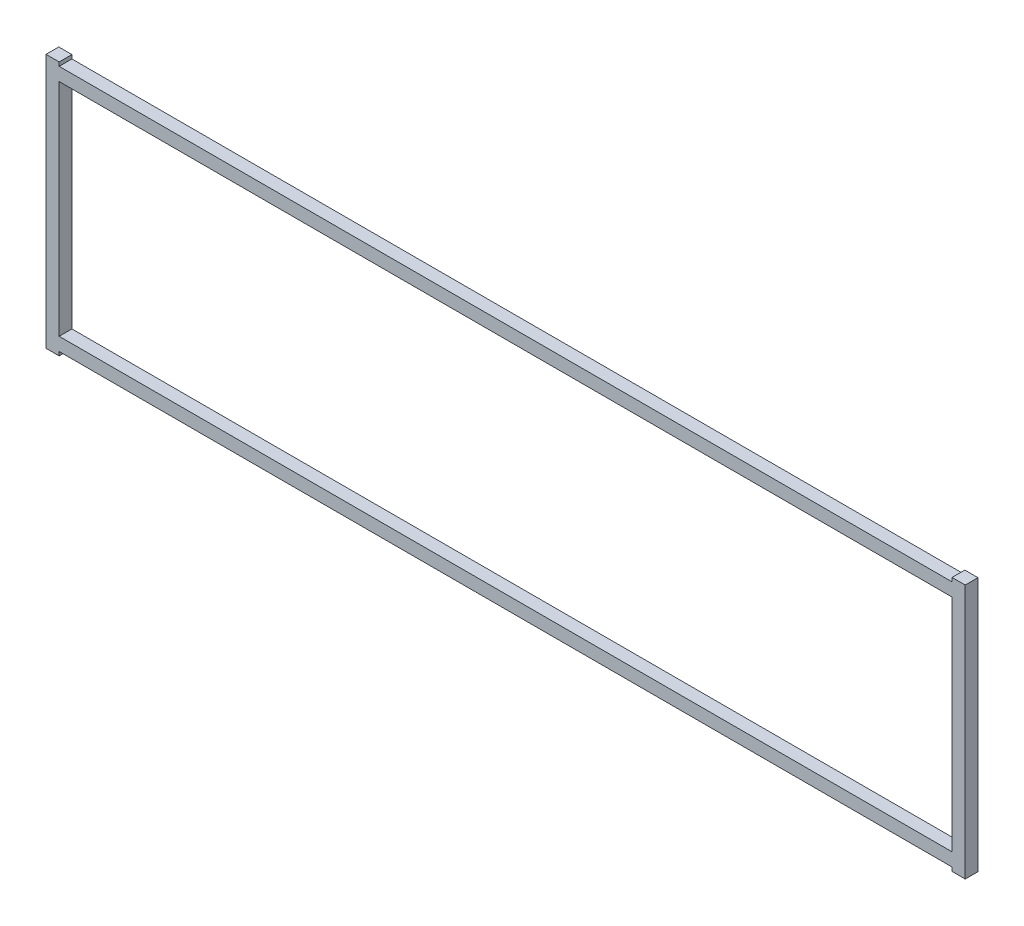
ISO-10303-21;
HEADER;
FILE_DESCRIPTION(('STEP AP214'),'2;1');
FILE_NAME('part.step','',(''),(''),'','','');
FILE_SCHEMA(('AUTOMOTIVE_DESIGN { 1 0 10303 214 1 1 1 1 }'));
ENDSEC;
DATA;
#1=APPLICATION_CONTEXT('core data for automotive mechanical design processes');
#2=APPLICATION_PROTOCOL_DEFINITION('international standard','automotive_design',2000,#1);
#3=PRODUCT_CONTEXT('',#1,'mechanical');
#4=PRODUCT('Part','Part','',(#3));
#5=PRODUCT_RELATED_PRODUCT_CATEGORY('part','',(#4));
#6=PRODUCT_DEFINITION_FORMATION('','',#4);
#7=PRODUCT_DEFINITION_CONTEXT('part definition',#1,'design');
#8=PRODUCT_DEFINITION('design','',#6,#7);
#9=PRODUCT_DEFINITION_SHAPE('','',#8);
#10=(LENGTH_UNIT() NAMED_UNIT(*) SI_UNIT(.MILLI.,.METRE.));
#11=(NAMED_UNIT(*) PLANE_ANGLE_UNIT() SI_UNIT($,.RADIAN.));
#12=(NAMED_UNIT(*) SI_UNIT($,.STERADIAN.) SOLID_ANGLE_UNIT());
#13=UNCERTAINTY_MEASURE_WITH_UNIT(LENGTH_MEASURE(1.E-05),#10,'distance_accuracy_value','');
#14=(GEOMETRIC_REPRESENTATION_CONTEXT(3) GLOBAL_UNCERTAINTY_ASSIGNED_CONTEXT((#13)) GLOBAL_UNIT_ASSIGNED_CONTEXT((#10,
#11,#12)) REPRESENTATION_CONTEXT('',''));
#15=CARTESIAN_POINT('',(0.,0.,0.));
#16=DIRECTION('',(0.,0.,1.));
#17=DIRECTION('',(1.,0.,0.));
#18=AXIS2_PLACEMENT_3D('',#15,#16,#17);
#19=CARTESIAN_POINT('',(0.,0.,6.35));
#20=DIRECTION('',(0.,0.,1.));
#21=DIRECTION('',(1.,0.,0.));
#22=AXIS2_PLACEMENT_3D('',#19,#20,#21);
#23=PLANE('',#22);
#24=DIRECTION('',(0.,-1.,0.));
#25=VECTOR('',#24,1.);
#26=CARTESIAN_POINT('',(222.1484,-61.445775,6.35));
#27=LINE('',#26,#25);
#28=CARTESIAN_POINT('',(222.1484,-61.445775,6.35));
#29=VERTEX_POINT('',#28);
#30=CARTESIAN_POINT('',(222.1484,-63.35395,6.35));
#31=VERTEX_POINT('',#30);
#32=EDGE_CURVE('E201',#29,#31,#27,.T.);
#33=ORIENTED_EDGE('',*,*,#32,.T.);
#34=DIRECTION('',(1.,0.,0.));
#35=VECTOR('',#34,1.);
#36=CARTESIAN_POINT('',(222.1484,-63.35395,6.35));
#37=LINE('',#36,#35);
#38=CARTESIAN_POINT('',(228.7016,-63.35395,6.35));
#39=VERTEX_POINT('',#38);
#40=EDGE_CURVE('E205',#31,#39,#37,.T.);
#41=ORIENTED_EDGE('',*,*,#40,.T.);
#42=DIRECTION('',(0.,1.,0.));
#43=VECTOR('',#42,1.);
#44=CARTESIAN_POINT('',(228.7016,-63.35395,6.35));
#45=LINE('',#44,#43);
#46=CARTESIAN_POINT('',(228.7016,63.35395,6.35));
#47=VERTEX_POINT('',#46);
#48=EDGE_CURVE('E209',#39,#47,#45,.T.);
#49=ORIENTED_EDGE('',*,*,#48,.T.);
#50=DIRECTION('',(-1.,0.,0.));
#51=VECTOR('',#50,1.);
#52=CARTESIAN_POINT('',(228.7016,63.35395,6.35));
#53=LINE('',#52,#51);
#54=CARTESIAN_POINT('',(222.1484,63.35395,6.35));
#55=VERTEX_POINT('',#54);
#56=EDGE_CURVE('E212',#47,#55,#53,.T.);
#57=ORIENTED_EDGE('',*,*,#56,.T.);
#58=DIRECTION('',(0.,-1.,0.));
#59=VECTOR('',#58,1.);
#60=CARTESIAN_POINT('',(222.1484,63.35395,6.35));
#61=LINE('',#60,#59);
#62=CARTESIAN_POINT('',(222.1484,61.445775,6.35));
#63=VERTEX_POINT('',#62);
#64=EDGE_CURVE('E215',#55,#63,#61,.T.);
#65=ORIENTED_EDGE('',*,*,#64,.T.);
#66=DIRECTION('',(-1.,0.,0.));
#67=VECTOR('',#66,1.);
#68=CARTESIAN_POINT('',(222.1484,61.445775,6.35));
#69=LINE('',#68,#67);
#70=CARTESIAN_POINT('',(-222.1484,61.445775,6.35));
#71=VERTEX_POINT('',#70);
#72=EDGE_CURVE('E218',#63,#71,#69,.T.);
#73=ORIENTED_EDGE('',*,*,#72,.T.);
#74=DIRECTION('',(0.,1.,0.));
#75=VECTOR('',#74,1.);
#76=CARTESIAN_POINT('',(-222.1484,61.445775,6.35));
#77=LINE('',#76,#75);
#78=CARTESIAN_POINT('',(-222.1484,63.35395,6.35));
#79=VERTEX_POINT('',#78);
#80=EDGE_CURVE('E221',#71,#79,#77,.T.);
#81=ORIENTED_EDGE('',*,*,#80,.T.);
#82=DIRECTION('',(-1.,0.,0.));
#83=VECTOR('',#82,1.);
#84=CARTESIAN_POINT('',(-222.1484,63.35395,6.35));
#85=LINE('',#84,#83);
#86=CARTESIAN_POINT('',(-228.7016,63.35395,6.35));
#87=VERTEX_POINT('',#86);
#88=EDGE_CURVE('E224',#79,#87,#85,.T.);
#89=ORIENTED_EDGE('',*,*,#88,.T.);
#90=DIRECTION('',(0.,-1.,0.));
#91=VECTOR('',#90,1.);
#92=CARTESIAN_POINT('',(-228.7016,63.35395,6.35));
#93=LINE('',#92,#91);
#94=CARTESIAN_POINT('',(-228.7016,-63.35395,6.35));
#95=VERTEX_POINT('',#94);
#96=EDGE_CURVE('E227',#87,#95,#93,.T.);
#97=ORIENTED_EDGE('',*,*,#96,.T.);
#98=DIRECTION('',(1.,0.,0.));
#99=VECTOR('',#98,1.);
#100=CARTESIAN_POINT('',(-228.7016,-63.35395,6.35));
#101=LINE('',#100,#99);
#102=CARTESIAN_POINT('',(-222.1484,-63.35395,6.35));
#103=VERTEX_POINT('',#102);
#104=EDGE_CURVE('E230',#95,#103,#101,.T.);
#105=ORIENTED_EDGE('',*,*,#104,.T.);
#106=DIRECTION('',(0.,1.,0.));
#107=VECTOR('',#106,1.);
#108=CARTESIAN_POINT('',(-222.1484,-63.35395,6.35));
#109=LINE('',#108,#107);
#110=CARTESIAN_POINT('',(-222.1484,-61.445775,6.35));
#111=VERTEX_POINT('',#110);
#112=EDGE_CURVE('E233',#103,#111,#109,.T.);
#113=ORIENTED_EDGE('',*,*,#112,.T.);
#114=DIRECTION('',(1.,0.,0.));
#115=VECTOR('',#114,1.);
#116=CARTESIAN_POINT('',(-222.1484,-61.445775,6.35));
#117=LINE('',#116,#115);
#118=EDGE_CURVE('E236',#111,#29,#117,.T.);
#119=ORIENTED_EDGE('',*,*,#118,.T.);
#120=EDGE_LOOP('',(#33,#41,#49,#57,#65,#73,#81,#89,#97,#105,#113,#119));
#121=FACE_BOUND('',#120,.T.);
#122=DIRECTION('',(1.,0.,0.));
#123=VECTOR('',#122,1.);
#124=CARTESIAN_POINT('',(-222.1484,-54.892575,6.35));
#125=LINE('',#124,#123);
#126=CARTESIAN_POINT('',(-222.1484,-54.892575,6.35));
#127=VERTEX_POINT('',#126);
#128=CARTESIAN_POINT('',(222.1484,-54.892575,6.35));
#129=VERTEX_POINT('',#128);
#130=EDGE_CURVE('E162',#127,#129,#125,.T.);
#131=ORIENTED_EDGE('',*,*,#130,.F.);
#132=DIRECTION('',(0.,-1.,0.));
#133=VECTOR('',#132,1.);
#134=CARTESIAN_POINT('',(-222.1484,54.892575,6.35));
#135=LINE('',#134,#133);
#136=CARTESIAN_POINT('',(-222.1484,54.892575,6.35));
#137=VERTEX_POINT('',#136);
#138=EDGE_CURVE('E153',#137,#127,#135,.T.);
#139=ORIENTED_EDGE('',*,*,#138,.F.);
#140=DIRECTION('',(-1.,0.,0.));
#141=VECTOR('',#140,1.);
#142=CARTESIAN_POINT('',(222.1484,54.892575,6.35));
#143=LINE('',#142,#141);
#144=CARTESIAN_POINT('',(222.1484,54.892575,6.35));
#145=VERTEX_POINT('',#144);
#146=EDGE_CURVE('E179',#145,#137,#143,.T.);
#147=ORIENTED_EDGE('',*,*,#146,.F.);
#148=DIRECTION('',(0.,1.,0.));
#149=VECTOR('',#148,1.);
#150=CARTESIAN_POINT('',(222.1484,-54.892575,6.35));
#151=LINE('',#150,#149);
#152=EDGE_CURVE('E175',#129,#145,#151,.T.);
#153=ORIENTED_EDGE('',*,*,#152,.F.);
#154=EDGE_LOOP('',(#131,#139,#147,#153));
#155=FACE_BOUND('',#154,.T.);
#156=ADVANCED_FACE('F39',(#121,#155),#23,.T.);
#157=CARTESIAN_POINT('',(0.,0.,0.));
#158=DIRECTION('',(0.,0.,1.));
#159=DIRECTION('',(1.,0.,0.));
#160=AXIS2_PLACEMENT_3D('',#157,#158,#159);
#161=PLANE('',#160);
#162=DIRECTION('',(0.,-1.,0.));
#163=VECTOR('',#162,1.);
#164=CARTESIAN_POINT('',(222.1484,-61.445775,0.));
#165=LINE('',#164,#163);
#166=CARTESIAN_POINT('',(222.1484,-61.445775,0.));
#167=VERTEX_POINT('',#166);
#168=CARTESIAN_POINT('',(222.1484,-63.35395,0.));
#169=VERTEX_POINT('',#168);
#170=EDGE_CURVE('E171',#167,#169,#165,.T.);
#171=ORIENTED_EDGE('',*,*,#170,.F.);
#172=DIRECTION('',(1.,0.,0.));
#173=VECTOR('',#172,1.);
#174=CARTESIAN_POINT('',(-222.1484,-61.445775,0.));
#175=LINE('',#174,#173);
#176=CARTESIAN_POINT('',(-222.1484,-61.445775,0.));
#177=VERTEX_POINT('',#176);
#178=EDGE_CURVE('E206',#177,#167,#175,.T.);
#179=ORIENTED_EDGE('',*,*,#178,.F.);
#180=DIRECTION('',(0.,1.,0.));
#181=VECTOR('',#180,1.);
#182=CARTESIAN_POINT('',(-222.1484,-63.35395,0.));
#183=LINE('',#182,#181);
#184=CARTESIAN_POINT('',(-222.1484,-63.35395,0.));
#185=VERTEX_POINT('',#184);
#186=EDGE_CURVE('E270',#185,#177,#183,.T.);
#187=ORIENTED_EDGE('',*,*,#186,.F.);
#188=DIRECTION('',(1.,0.,0.));
#189=VECTOR('',#188,1.);
#190=CARTESIAN_POINT('',(-228.7016,-63.35395,0.));
#191=LINE('',#190,#189);
#192=CARTESIAN_POINT('',(-228.7016,-63.35395,0.));
#193=VERTEX_POINT('',#192);
#194=EDGE_CURVE('E267',#193,#185,#191,.T.);
#195=ORIENTED_EDGE('',*,*,#194,.F.);
#196=DIRECTION('',(0.,-1.,0.));
#197=VECTOR('',#196,1.);
#198=CARTESIAN_POINT('',(-228.7016,63.35395,0.));
#199=LINE('',#198,#197);
#200=CARTESIAN_POINT('',(-228.7016,63.35395,0.));
#201=VERTEX_POINT('',#200);
#202=EDGE_CURVE('E264',#201,#193,#199,.T.);
#203=ORIENTED_EDGE('',*,*,#202,.F.);
#204=DIRECTION('',(-1.,0.,0.));
#205=VECTOR('',#204,1.);
#206=CARTESIAN_POINT('',(-222.1484,63.35395,0.));
#207=LINE('',#206,#205);
#208=CARTESIAN_POINT('',(-222.1484,63.35395,0.));
#209=VERTEX_POINT('',#208);
#210=EDGE_CURVE('E261',#209,#201,#207,.T.);
#211=ORIENTED_EDGE('',*,*,#210,.F.);
#212=DIRECTION('',(0.,1.,0.));
#213=VECTOR('',#212,1.);
#214=CARTESIAN_POINT('',(-222.1484,61.445775,0.));
#215=LINE('',#214,#213);
#216=CARTESIAN_POINT('',(-222.1484,61.445775,0.));
#217=VERTEX_POINT('',#216);
#218=EDGE_CURVE('E258',#217,#209,#215,.T.);
#219=ORIENTED_EDGE('',*,*,#218,.F.);
#220=DIRECTION('',(-1.,0.,0.));
#221=VECTOR('',#220,1.);
#222=CARTESIAN_POINT('',(222.1484,61.445775,0.));
#223=LINE('',#222,#221);
#224=CARTESIAN_POINT('',(222.1484,61.445775,0.));
#225=VERTEX_POINT('',#224);
#226=EDGE_CURVE('E255',#225,#217,#223,.T.);
#227=ORIENTED_EDGE('',*,*,#226,.F.);
#228=DIRECTION('',(0.,-1.,0.));
#229=VECTOR('',#228,1.);
#230=CARTESIAN_POINT('',(222.1484,63.35395,0.));
#231=LINE('',#230,#229);
#232=CARTESIAN_POINT('',(222.1484,63.35395,0.));
#233=VERTEX_POINT('',#232);
#234=EDGE_CURVE('E252',#233,#225,#231,.T.);
#235=ORIENTED_EDGE('',*,*,#234,.F.);
#236=DIRECTION('',(-1.,0.,0.));
#237=VECTOR('',#236,1.);
#238=CARTESIAN_POINT('',(228.7016,63.35395,0.));
#239=LINE('',#238,#237);
#240=CARTESIAN_POINT('',(228.7016,63.35395,0.));
#241=VERTEX_POINT('',#240);
#242=EDGE_CURVE('E249',#241,#233,#239,.T.);
#243=ORIENTED_EDGE('',*,*,#242,.F.);
#244=DIRECTION('',(0.,1.,0.));
#245=VECTOR('',#244,1.);
#246=CARTESIAN_POINT('',(228.7016,-63.35395,0.));
#247=LINE('',#246,#245);
#248=CARTESIAN_POINT('',(228.7016,-63.35395,0.));
#249=VERTEX_POINT('',#248);
#250=EDGE_CURVE('E246',#249,#241,#247,.T.);
#251=ORIENTED_EDGE('',*,*,#250,.F.);
#252=DIRECTION('',(1.,0.,0.));
#253=VECTOR('',#252,1.);
#254=CARTESIAN_POINT('',(222.1484,-63.35395,0.));
#255=LINE('',#254,#253);
#256=EDGE_CURVE('E243',#169,#249,#255,.T.);
#257=ORIENTED_EDGE('',*,*,#256,.F.);
#258=EDGE_LOOP('',(#171,#179,#187,#195,#203,#211,#219,#227,#235,#243,#251,#257));
#259=FACE_BOUND('',#258,.T.);
#260=DIRECTION('',(0.,-1.,0.));
#261=VECTOR('',#260,1.);
#262=CARTESIAN_POINT('',(-222.1484,54.892575,0.));
#263=LINE('',#262,#261);
#264=CARTESIAN_POINT('',(-222.1484,54.892575,0.));
#265=VERTEX_POINT('',#264);
#266=CARTESIAN_POINT('',(-222.1484,-54.892575,0.));
#267=VERTEX_POINT('',#266);
#268=EDGE_CURVE('E63',#265,#267,#263,.T.);
#269=ORIENTED_EDGE('',*,*,#268,.T.);
#270=DIRECTION('',(1.,0.,0.));
#271=VECTOR('',#270,1.);
#272=CARTESIAN_POINT('',(-222.1484,-54.892575,0.));
#273=LINE('',#272,#271);
#274=CARTESIAN_POINT('',(222.1484,-54.892575,0.));
#275=VERTEX_POINT('',#274);
#276=EDGE_CURVE('E169',#267,#275,#273,.T.);
#277=ORIENTED_EDGE('',*,*,#276,.T.);
#278=DIRECTION('',(0.,1.,0.));
#279=VECTOR('',#278,1.);
#280=CARTESIAN_POINT('',(222.1484,-54.892575,0.));
#281=LINE('',#280,#279);
#282=CARTESIAN_POINT('',(222.1484,54.892575,0.));
#283=VERTEX_POINT('',#282);
#284=EDGE_CURVE('E188',#275,#283,#281,.T.);
#285=ORIENTED_EDGE('',*,*,#284,.T.);
#286=DIRECTION('',(-1.,0.,0.));
#287=VECTOR('',#286,1.);
#288=CARTESIAN_POINT('',(222.1484,54.892575,0.));
#289=LINE('',#288,#287);
#290=EDGE_CURVE('E163',#283,#265,#289,.T.);
#291=ORIENTED_EDGE('',*,*,#290,.T.);
#292=EDGE_LOOP('',(#269,#277,#285,#291));
#293=FACE_BOUND('',#292,.T.);
#294=ADVANCED_FACE('F325',(#259,#293),#161,.F.);
#295=CARTESIAN_POINT('',(222.1484,-61.445775,6.35));
#296=DIRECTION('',(1.,0.,0.));
#297=DIRECTION('',(0.,0.,-1.));
#298=AXIS2_PLACEMENT_3D('',#295,#296,#297);
#299=PLANE('',#298);
#300=ORIENTED_EDGE('',*,*,#170,.T.);
#301=DIRECTION('',(0.,0.,-1.));
#302=VECTOR('',#301,1.);
#303=CARTESIAN_POINT('',(222.1484,-63.35395,6.35));
#304=LINE('',#303,#302);
#305=EDGE_CURVE('E11',#31,#169,#304,.T.);
#306=ORIENTED_EDGE('',*,*,#305,.F.);
#307=ORIENTED_EDGE('',*,*,#32,.F.);
#308=DIRECTION('',(0.,0.,-1.));
#309=VECTOR('',#308,1.);
#310=CARTESIAN_POINT('',(222.1484,-61.445775,6.35));
#311=LINE('',#310,#309);
#312=EDGE_CURVE('E239',#29,#167,#311,.T.);
#313=ORIENTED_EDGE('',*,*,#312,.T.);
#314=EDGE_LOOP('',(#300,#306,#307,#313));
#315=FACE_BOUND('',#314,.T.);
#316=ADVANCED_FACE('F41',(#315),#299,.F.);
#317=CARTESIAN_POINT('',(222.1484,-63.35395,6.35));
#318=DIRECTION('',(0.,1.,0.));
#319=DIRECTION('',(0.,0.,1.));
#320=AXIS2_PLACEMENT_3D('',#317,#318,#319);
#321=PLANE('',#320);
#322=ORIENTED_EDGE('',*,*,#256,.T.);
#323=DIRECTION('',(0.,0.,-1.));
#324=VECTOR('',#323,1.);
#325=CARTESIAN_POINT('',(228.7016,-63.35395,6.35));
#326=LINE('',#325,#324);
#327=EDGE_CURVE('E48',#39,#249,#326,.T.);
#328=ORIENTED_EDGE('',*,*,#327,.F.);
#329=ORIENTED_EDGE('',*,*,#40,.F.);
#330=ORIENTED_EDGE('',*,*,#305,.T.);
#331=EDGE_LOOP('',(#322,#328,#329,#330));
#332=FACE_BOUND('',#331,.T.);
#333=ADVANCED_FACE('F342',(#332),#321,.F.);
#334=CARTESIAN_POINT('',(228.7016,-63.35395,6.35));
#335=DIRECTION('',(-1.,0.,0.));
#336=DIRECTION('',(0.,0.,1.));
#337=AXIS2_PLACEMENT_3D('',#334,#335,#336);
#338=PLANE('',#337);
#339=ORIENTED_EDGE('',*,*,#250,.T.);
#340=DIRECTION('',(0.,0.,-1.));
#341=VECTOR('',#340,1.);
#342=CARTESIAN_POINT('',(228.7016,63.35395,6.35));
#343=LINE('',#342,#341);
#344=EDGE_CURVE('E310',#47,#241,#343,.T.);
#345=ORIENTED_EDGE('',*,*,#344,.F.);
#346=ORIENTED_EDGE('',*,*,#48,.F.);
#347=ORIENTED_EDGE('',*,*,#327,.T.);
#348=EDGE_LOOP('',(#339,#345,#346,#347));
#349=FACE_BOUND('',#348,.T.);
#350=ADVANCED_FACE('F319',(#349),#338,.F.);
#351=CARTESIAN_POINT('',(228.7016,63.35395,6.35));
#352=DIRECTION('',(0.,-1.,0.));
#353=DIRECTION('',(0.,0.,-1.));
#354=AXIS2_PLACEMENT_3D('',#351,#352,#353);
#355=PLANE('',#354);
#356=ORIENTED_EDGE('',*,*,#242,.T.);
#357=DIRECTION('',(0.,0.,-1.));
#358=VECTOR('',#357,1.);
#359=CARTESIAN_POINT('',(222.1484,63.35395,6.35));
#360=LINE('',#359,#358);
#361=EDGE_CURVE('E306',#55,#233,#360,.T.);
#362=ORIENTED_EDGE('',*,*,#361,.F.);
#363=ORIENTED_EDGE('',*,*,#56,.F.);
#364=ORIENTED_EDGE('',*,*,#344,.T.);
#365=EDGE_LOOP('',(#356,#362,#363,#364));
#366=FACE_BOUND('',#365,.T.);
#367=ADVANCED_FACE('F331',(#366),#355,.F.);
#368=CARTESIAN_POINT('',(222.1484,63.35395,6.35));
#369=DIRECTION('',(1.,0.,0.));
#370=DIRECTION('',(0.,1.,0.));
#371=AXIS2_PLACEMENT_3D('',#368,#369,#370);
#372=PLANE('',#371);
#373=ORIENTED_EDGE('',*,*,#234,.T.);
#374=DIRECTION('',(0.,0.,-1.));
#375=VECTOR('',#374,1.);
#376=CARTESIAN_POINT('',(222.1484,61.445775,6.35));
#377=LINE('',#376,#375);
#378=EDGE_CURVE('E302',#63,#225,#377,.T.);
#379=ORIENTED_EDGE('',*,*,#378,.F.);
#380=ORIENTED_EDGE('',*,*,#64,.F.);
#381=ORIENTED_EDGE('',*,*,#361,.T.);
#382=EDGE_LOOP('',(#373,#379,#380,#381));
#383=FACE_BOUND('',#382,.T.);
#384=ADVANCED_FACE('F335',(#383),#372,.F.);
#385=CARTESIAN_POINT('',(222.1484,61.445775,6.35));
#386=DIRECTION('',(0.,-1.,0.));
#387=DIRECTION('',(0.,0.,-1.));
#388=AXIS2_PLACEMENT_3D('',#385,#386,#387);
#389=PLANE('',#388);
#390=ORIENTED_EDGE('',*,*,#226,.T.);
#391=DIRECTION('',(0.,0.,-1.));
#392=VECTOR('',#391,1.);
#393=CARTESIAN_POINT('',(-222.1484,61.445775,6.35));
#394=LINE('',#393,#392);
#395=EDGE_CURVE('E298',#71,#217,#394,.T.);
#396=ORIENTED_EDGE('',*,*,#395,.F.);
#397=ORIENTED_EDGE('',*,*,#72,.F.);
#398=ORIENTED_EDGE('',*,*,#378,.T.);
#399=EDGE_LOOP('',(#390,#396,#397,#398));
#400=FACE_BOUND('',#399,.T.);
#401=ADVANCED_FACE('F375',(#400),#389,.F.);
#402=CARTESIAN_POINT('',(-222.1484,61.445775,6.35));
#403=DIRECTION('',(-1.,0.,0.));
#404=DIRECTION('',(0.,0.,1.));
#405=AXIS2_PLACEMENT_3D('',#402,#403,#404);
#406=PLANE('',#405);
#407=ORIENTED_EDGE('',*,*,#218,.T.);
#408=DIRECTION('',(0.,0.,-1.));
#409=VECTOR('',#408,1.);
#410=CARTESIAN_POINT('',(-222.1484,63.35395,6.35));
#411=LINE('',#410,#409);
#412=EDGE_CURVE('E294',#79,#209,#411,.T.);
#413=ORIENTED_EDGE('',*,*,#412,.F.);
#414=ORIENTED_EDGE('',*,*,#80,.F.);
#415=ORIENTED_EDGE('',*,*,#395,.T.);
#416=EDGE_LOOP('',(#407,#413,#414,#415));
#417=FACE_BOUND('',#416,.T.);
#418=ADVANCED_FACE('F373',(#417),#406,.F.);
#419=CARTESIAN_POINT('',(-222.1484,63.35395,6.35));
#420=DIRECTION('',(0.,-1.,0.));
#421=DIRECTION('',(0.,0.,-1.));
#422=AXIS2_PLACEMENT_3D('',#419,#420,#421);
#423=PLANE('',#422);
#424=ORIENTED_EDGE('',*,*,#210,.T.);
#425=DIRECTION('',(0.,0.,-1.));
#426=VECTOR('',#425,1.);
#427=CARTESIAN_POINT('',(-228.7016,63.35395,6.35));
#428=LINE('',#427,#426);
#429=EDGE_CURVE('E290',#87,#201,#428,.T.);
#430=ORIENTED_EDGE('',*,*,#429,.F.);
#431=ORIENTED_EDGE('',*,*,#88,.F.);
#432=ORIENTED_EDGE('',*,*,#412,.T.);
#433=EDGE_LOOP('',(#424,#430,#431,#432));
#434=FACE_BOUND('',#433,.T.);
#435=ADVANCED_FACE('F369',(#434),#423,.F.);
#436=CARTESIAN_POINT('',(-228.7016,63.35395,6.35));
#437=DIRECTION('',(1.,0.,0.));
#438=DIRECTION('',(0.,0.,-1.));
#439=AXIS2_PLACEMENT_3D('',#436,#437,#438);
#440=PLANE('',#439);
#441=ORIENTED_EDGE('',*,*,#202,.T.);
#442=DIRECTION('',(0.,0.,-1.));
#443=VECTOR('',#442,1.);
#444=CARTESIAN_POINT('',(-228.7016,-63.35395,6.35));
#445=LINE('',#444,#443);
#446=EDGE_CURVE('E286',#95,#193,#445,.T.);
#447=ORIENTED_EDGE('',*,*,#446,.F.);
#448=ORIENTED_EDGE('',*,*,#96,.F.);
#449=ORIENTED_EDGE('',*,*,#429,.T.);
#450=EDGE_LOOP('',(#441,#447,#448,#449));
#451=FACE_BOUND('',#450,.T.);
#452=ADVANCED_FACE('F364',(#451),#440,.F.);
#453=CARTESIAN_POINT('',(-228.7016,-63.35395,6.35));
#454=DIRECTION('',(0.,1.,0.));
#455=DIRECTION('',(0.,0.,1.));
#456=AXIS2_PLACEMENT_3D('',#453,#454,#455);
#457=PLANE('',#456);
#458=ORIENTED_EDGE('',*,*,#194,.T.);
#459=DIRECTION('',(0.,0.,-1.));
#460=VECTOR('',#459,1.);
#461=CARTESIAN_POINT('',(-222.1484,-63.35395,6.35));
#462=LINE('',#461,#460);
#463=EDGE_CURVE('E282',#103,#185,#462,.T.);
#464=ORIENTED_EDGE('',*,*,#463,.F.);
#465=ORIENTED_EDGE('',*,*,#104,.F.);
#466=ORIENTED_EDGE('',*,*,#446,.T.);
#467=EDGE_LOOP('',(#458,#464,#465,#466));
#468=FACE_BOUND('',#467,.T.);
#469=ADVANCED_FACE('F358',(#468),#457,.F.);
#470=CARTESIAN_POINT('',(-222.1484,-63.35395,6.35));
#471=DIRECTION('',(-1.,0.,0.));
#472=DIRECTION('',(0.,-1.,0.));
#473=AXIS2_PLACEMENT_3D('',#470,#471,#472);
#474=PLANE('',#473);
#475=ORIENTED_EDGE('',*,*,#186,.T.);
#476=DIRECTION('',(0.,0.,-1.));
#477=VECTOR('',#476,1.);
#478=CARTESIAN_POINT('',(-222.1484,-61.445775,6.35));
#479=LINE('',#478,#477);
#480=EDGE_CURVE('E278',#111,#177,#479,.T.);
#481=ORIENTED_EDGE('',*,*,#480,.F.);
#482=ORIENTED_EDGE('',*,*,#112,.F.);
#483=ORIENTED_EDGE('',*,*,#463,.T.);
#484=EDGE_LOOP('',(#475,#481,#482,#483));
#485=FACE_BOUND('',#484,.T.);
#486=ADVANCED_FACE('F354',(#485),#474,.F.);
#487=CARTESIAN_POINT('',(-222.1484,-61.445775,6.35));
#488=DIRECTION('',(0.,1.,0.));
#489=DIRECTION('',(0.,0.,1.));
#490=AXIS2_PLACEMENT_3D('',#487,#488,#489);
#491=PLANE('',#490);
#492=ORIENTED_EDGE('',*,*,#178,.T.);
#493=ORIENTED_EDGE('',*,*,#312,.F.);
#494=ORIENTED_EDGE('',*,*,#118,.F.);
#495=ORIENTED_EDGE('',*,*,#480,.T.);
#496=EDGE_LOOP('',(#492,#493,#494,#495));
#497=FACE_BOUND('',#496,.T.);
#498=ADVANCED_FACE('F349',(#497),#491,.F.);
#499=CARTESIAN_POINT('',(-222.1484,54.892575,6.35));
#500=DIRECTION('',(1.,0.,0.));
#501=DIRECTION('',(0.,0.,-1.));
#502=AXIS2_PLACEMENT_3D('',#499,#500,#501);
#503=PLANE('',#502);
#504=ORIENTED_EDGE('',*,*,#268,.F.);
#505=DIRECTION('',(0.,0.,-1.));
#506=VECTOR('',#505,1.);
#507=CARTESIAN_POINT('',(-222.1484,54.892575,6.35));
#508=LINE('',#507,#506);
#509=EDGE_CURVE('E157',#137,#265,#508,.T.);
#510=ORIENTED_EDGE('',*,*,#509,.F.);
#511=ORIENTED_EDGE('',*,*,#138,.T.);
#512=DIRECTION('',(0.,0.,-1.));
#513=VECTOR('',#512,1.);
#514=CARTESIAN_POINT('',(-222.1484,-54.892575,6.35));
#515=LINE('',#514,#513);
#516=EDGE_CURVE('E156',#127,#267,#515,.T.);
#517=ORIENTED_EDGE('',*,*,#516,.T.);
#518=EDGE_LOOP('',(#504,#510,#511,#517));
#519=FACE_BOUND('',#518,.T.);
#520=ADVANCED_FACE('F155',(#519),#503,.T.);
#521=CARTESIAN_POINT('',(-222.1484,-54.892575,6.35));
#522=DIRECTION('',(0.,1.,0.));
#523=DIRECTION('',(0.,0.,1.));
#524=AXIS2_PLACEMENT_3D('',#521,#522,#523);
#525=PLANE('',#524);
#526=ORIENTED_EDGE('',*,*,#276,.F.);
#527=ORIENTED_EDGE('',*,*,#516,.F.);
#528=ORIENTED_EDGE('',*,*,#130,.T.);
#529=DIRECTION('',(0.,0.,-1.));
#530=VECTOR('',#529,1.);
#531=CARTESIAN_POINT('',(222.1484,-54.892575,6.35));
#532=LINE('',#531,#530);
#533=EDGE_CURVE('E172',#129,#275,#532,.T.);
#534=ORIENTED_EDGE('',*,*,#533,.T.);
#535=EDGE_LOOP('',(#526,#527,#528,#534));
#536=FACE_BOUND('',#535,.T.);
#537=ADVANCED_FACE('F166',(#536),#525,.T.);
#538=CARTESIAN_POINT('',(222.1484,-54.892575,6.35));
#539=DIRECTION('',(-1.,0.,0.));
#540=DIRECTION('',(0.,0.,1.));
#541=AXIS2_PLACEMENT_3D('',#538,#539,#540);
#542=PLANE('',#541);
#543=ORIENTED_EDGE('',*,*,#284,.F.);
#544=ORIENTED_EDGE('',*,*,#533,.F.);
#545=ORIENTED_EDGE('',*,*,#152,.T.);
#546=DIRECTION('',(0.,0.,-1.));
#547=VECTOR('',#546,1.);
#548=CARTESIAN_POINT('',(222.1484,54.892575,6.35));
#549=LINE('',#548,#547);
#550=EDGE_CURVE('E55',#145,#283,#549,.T.);
#551=ORIENTED_EDGE('',*,*,#550,.T.);
#552=EDGE_LOOP('',(#543,#544,#545,#551));
#553=FACE_BOUND('',#552,.T.);
#554=ADVANCED_FACE('F433',(#553),#542,.T.);
#555=CARTESIAN_POINT('',(222.1484,54.892575,6.35));
#556=DIRECTION('',(0.,-1.,0.));
#557=DIRECTION('',(0.,0.,-1.));
#558=AXIS2_PLACEMENT_3D('',#555,#556,#557);
#559=PLANE('',#558);
#560=ORIENTED_EDGE('',*,*,#290,.F.);
#561=ORIENTED_EDGE('',*,*,#550,.F.);
#562=ORIENTED_EDGE('',*,*,#146,.T.);
#563=ORIENTED_EDGE('',*,*,#509,.T.);
#564=EDGE_LOOP('',(#560,#561,#562,#563));
#565=FACE_BOUND('',#564,.T.);
#566=ADVANCED_FACE('F439',(#565),#559,.T.);
#567=CLOSED_SHELL('',(#156,#294,#316,#333,#350,#367,#384,#401,#418,#435,#452,#469,#486,#498,
#520,#537,#554,#566));
#568=MANIFOLD_SOLID_BREP('B2',#567);
#569=ADVANCED_BREP_SHAPE_REPRESENTATION('',(#18,#568),#14);
#570=SHAPE_DEFINITION_REPRESENTATION(#9,#569);
ENDSEC;
END-ISO-10303-21;
